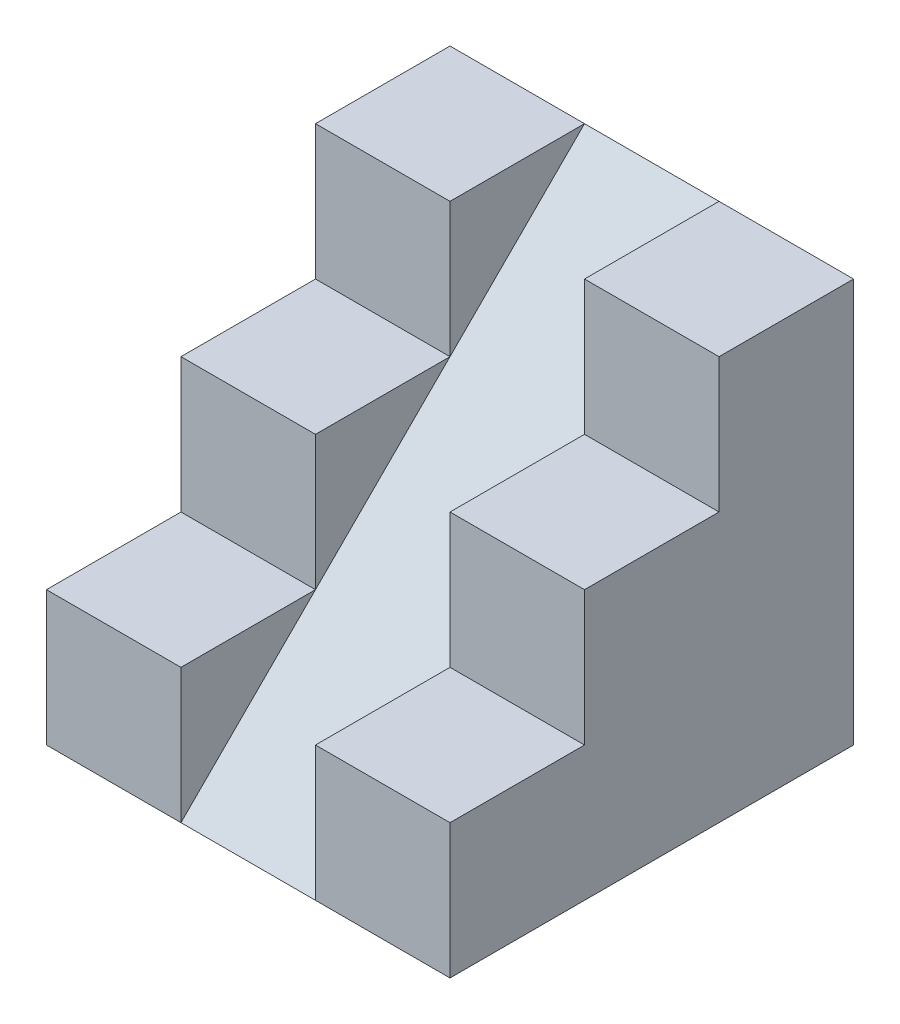
ISO-10303-21;
HEADER;
FILE_DESCRIPTION(('STEP AP214'),'2;1');
FILE_NAME('part.step','',(''),(''),'','','');
FILE_SCHEMA(('AUTOMOTIVE_DESIGN { 1 0 10303 214 1 1 1 1 }'));
ENDSEC;
DATA;
#1=APPLICATION_CONTEXT('core data for automotive mechanical design processes');
#2=APPLICATION_PROTOCOL_DEFINITION('international standard','automotive_design',2000,#1);
#3=PRODUCT_CONTEXT('',#1,'mechanical');
#4=PRODUCT('Part','Part','',(#3));
#5=PRODUCT_RELATED_PRODUCT_CATEGORY('part','',(#4));
#6=PRODUCT_DEFINITION_FORMATION('','',#4);
#7=PRODUCT_DEFINITION_CONTEXT('part definition',#1,'design');
#8=PRODUCT_DEFINITION('design','',#6,#7);
#9=PRODUCT_DEFINITION_SHAPE('','',#8);
#10=(LENGTH_UNIT() NAMED_UNIT(*) SI_UNIT(.MILLI.,.METRE.));
#11=(NAMED_UNIT(*) PLANE_ANGLE_UNIT() SI_UNIT($,.RADIAN.));
#12=(NAMED_UNIT(*) SI_UNIT($,.STERADIAN.) SOLID_ANGLE_UNIT());
#13=UNCERTAINTY_MEASURE_WITH_UNIT(LENGTH_MEASURE(1.E-05),#10,'distance_accuracy_value','');
#14=(GEOMETRIC_REPRESENTATION_CONTEXT(3) GLOBAL_UNCERTAINTY_ASSIGNED_CONTEXT((#13)) GLOBAL_UNIT_ASSIGNED_CONTEXT((#10,
#11,#12)) REPRESENTATION_CONTEXT('',''));
#15=CARTESIAN_POINT('',(0.,0.,0.));
#16=DIRECTION('',(0.,0.,1.));
#17=DIRECTION('',(1.,0.,0.));
#18=AXIS2_PLACEMENT_3D('',#15,#16,#17);
#19=CARTESIAN_POINT('',(0.,19.9999999999997,0.));
#20=DIRECTION('',(0.,1.,0.));
#21=DIRECTION('',(0.,0.,1.));
#22=AXIS2_PLACEMENT_3D('',#19,#20,#21);
#23=PLANE('',#22);
#24=DIRECTION('',(1.,0.,0.));
#25=VECTOR('',#24,1.);
#26=CARTESIAN_POINT('',(0.,19.9999999999997,60.));
#27=LINE('',#26,#25);
#28=CARTESIAN_POINT('',(0.,19.9999999999997,60.));
#29=VERTEX_POINT('',#28);
#30=CARTESIAN_POINT('',(20.,19.9999999999997,60.));
#31=VERTEX_POINT('',#30);
#32=EDGE_CURVE('E219',#29,#31,#27,.T.);
#33=ORIENTED_EDGE('',*,*,#32,.T.);
#34=DIRECTION('',(0.,0.,1.));
#35=VECTOR('',#34,1.);
#36=CARTESIAN_POINT('',(20.,19.9999999999997,60.));
#37=LINE('',#36,#35);
#38=CARTESIAN_POINT('',(20.,19.9999999999999,40.0000000000001));
#39=VERTEX_POINT('',#38);
#40=EDGE_CURVE('E261',#39,#31,#37,.T.);
#41=ORIENTED_EDGE('',*,*,#40,.F.);
#42=DIRECTION('',(1.,0.,0.));
#43=VECTOR('',#42,1.);
#44=CARTESIAN_POINT('',(0.,19.9999999999999,40.0000000000001));
#45=LINE('',#44,#43);
#46=CARTESIAN_POINT('',(0.,19.9999999999999,40.0000000000001));
#47=VERTEX_POINT('',#46);
#48=EDGE_CURVE('E195',#47,#39,#45,.T.);
#49=ORIENTED_EDGE('',*,*,#48,.F.);
#50=DIRECTION('',(0.,0.,1.));
#51=VECTOR('',#50,1.);
#52=CARTESIAN_POINT('',(0.,19.9999999999997,0.));
#53=LINE('',#52,#51);
#54=EDGE_CURVE('E54',#47,#29,#53,.T.);
#55=ORIENTED_EDGE('',*,*,#54,.T.);
#56=EDGE_LOOP('',(#33,#41,#49,#55));
#57=FACE_BOUND('',#56,.T.);
#58=ADVANCED_FACE('F39',(#57),#23,.T.);
#59=CARTESIAN_POINT('',(0.,0.,60.));
#60=DIRECTION('',(0.,0.,-1.));
#61=DIRECTION('',(-1.,0.,0.));
#62=AXIS2_PLACEMENT_3D('',#59,#60,#61);
#63=PLANE('',#62);
#64=DIRECTION('',(0.,-1.,0.));
#65=VECTOR('',#64,1.);
#66=CARTESIAN_POINT('',(20.,0.,60.));
#67=LINE('',#66,#65);
#68=CARTESIAN_POINT('',(20.,0.,60.));
#69=VERTEX_POINT('',#68);
#70=EDGE_CURVE('E256',#31,#69,#67,.T.);
#71=ORIENTED_EDGE('',*,*,#70,.F.);
#72=ORIENTED_EDGE('',*,*,#32,.F.);
#73=DIRECTION('',(0.,-1.,0.));
#74=VECTOR('',#73,1.);
#75=CARTESIAN_POINT('',(0.,0.,60.));
#76=LINE('',#75,#74);
#77=CARTESIAN_POINT('',(0.,0.,60.));
#78=VERTEX_POINT('',#77);
#79=EDGE_CURVE('E125',#29,#78,#76,.T.);
#80=ORIENTED_EDGE('',*,*,#79,.T.);
#81=DIRECTION('',(1.,0.,0.));
#82=VECTOR('',#81,1.);
#83=CARTESIAN_POINT('',(0.,0.,60.));
#84=LINE('',#83,#82);
#85=EDGE_CURVE('E229',#78,#69,#84,.T.);
#86=ORIENTED_EDGE('',*,*,#85,.T.);
#87=EDGE_LOOP('',(#71,#72,#80,#86));
#88=FACE_BOUND('',#87,.T.);
#89=ADVANCED_FACE('F346',(#88),#63,.F.);
#90=DIRECTION('',(0.,0.,1.));
#91=VECTOR('',#90,1.);
#92=CARTESIAN_POINT('',(40.,19.9999999999997,60.));
#93=LINE('',#92,#91);
#94=CARTESIAN_POINT('',(40.,19.9999999999999,40.0000000000001));
#95=VERTEX_POINT('',#94);
#96=CARTESIAN_POINT('',(40.,19.9999999999997,60.));
#97=VERTEX_POINT('',#96);
#98=EDGE_CURVE('E247',#95,#97,#93,.T.);
#99=ORIENTED_EDGE('',*,*,#98,.T.);
#100=CARTESIAN_POINT('',(60.,19.9999999999997,60.));
#101=VERTEX_POINT('',#100);
#102=EDGE_CURVE('E221',#97,#101,#27,.T.);
#103=ORIENTED_EDGE('',*,*,#102,.T.);
#104=DIRECTION('',(0.,0.,1.));
#105=VECTOR('',#104,1.);
#106=CARTESIAN_POINT('',(60.,19.9999999999997,0.));
#107=LINE('',#106,#105);
#108=CARTESIAN_POINT('',(60.,19.9999999999999,40.0000000000001));
#109=VERTEX_POINT('',#108);
#110=EDGE_CURVE('E203',#109,#101,#107,.T.);
#111=ORIENTED_EDGE('',*,*,#110,.F.);
#112=EDGE_CURVE('E200',#95,#109,#45,.T.);
#113=ORIENTED_EDGE('',*,*,#112,.F.);
#114=EDGE_LOOP('',(#99,#103,#111,#113));
#115=FACE_BOUND('',#114,.T.);
#116=ADVANCED_FACE('F245',(#115),#23,.T.);
#117=CARTESIAN_POINT('',(40.,19.9999999999999,20.0000000000001));
#118=DIRECTION('',(-1.,0.,0.));
#119=DIRECTION('',(0.,0.,1.));
#120=AXIS2_PLACEMENT_3D('',#117,#118,#119);
#121=PLANE('',#120);
#122=DIRECTION('',(0.,0.,1.));
#123=VECTOR('',#122,1.);
#124=CARTESIAN_POINT('',(40.,39.9999999999999,20.0000000000001));
#125=LINE('',#124,#123);
#126=CARTESIAN_POINT('',(40.,40.,20.0000000000001));
#127=VERTEX_POINT('',#126);
#128=CARTESIAN_POINT('',(40.,39.9999999999999,40.0000000000001));
#129=VERTEX_POINT('',#128);
#130=EDGE_CURVE('E192',#127,#129,#125,.T.);
#131=ORIENTED_EDGE('',*,*,#130,.F.);
#132=DIRECTION('',(0.,-0.707106781186548,0.707106781186548));
#133=VECTOR('',#132,1.);
#134=CARTESIAN_POINT('',(40.,30.,30.));
#135=LINE('',#134,#133);
#136=EDGE_CURVE('E269',#127,#95,#135,.T.);
#137=ORIENTED_EDGE('',*,*,#136,.T.);
#138=DIRECTION('',(0.,1.,0.));
#139=VECTOR('',#138,1.);
#140=CARTESIAN_POINT('',(40.,19.9999999999999,40.0000000000001));
#141=LINE('',#140,#139);
#142=EDGE_CURVE('E281',#95,#129,#141,.T.);
#143=ORIENTED_EDGE('',*,*,#142,.T.);
#144=EDGE_LOOP('',(#131,#137,#143));
#145=FACE_BOUND('',#144,.T.);
#146=ADVANCED_FACE('F305',(#145),#121,.T.);
#147=CARTESIAN_POINT('',(20.,19.9999999999999,20.0000000000001));
#148=DIRECTION('',(-1.,0.,0.));
#149=DIRECTION('',(0.,0.,1.));
#150=AXIS2_PLACEMENT_3D('',#147,#148,#149);
#151=PLANE('',#150);
#152=DIRECTION('',(0.,-0.707106781186548,0.707106781186548));
#153=VECTOR('',#152,1.);
#154=CARTESIAN_POINT('',(20.,30.,30.));
#155=LINE('',#154,#153);
#156=CARTESIAN_POINT('',(20.,39.9999999999999,20.0000000000001));
#157=VERTEX_POINT('',#156);
#158=EDGE_CURVE('E268',#157,#39,#155,.T.);
#159=ORIENTED_EDGE('',*,*,#158,.F.);
#160=DIRECTION('',(0.,0.,1.));
#161=VECTOR('',#160,1.);
#162=CARTESIAN_POINT('',(20.,39.9999999999999,20.0000000000001));
#163=LINE('',#162,#161);
#164=CARTESIAN_POINT('',(20.,39.9999999999999,40.0000000000001));
#165=VERTEX_POINT('',#164);
#166=EDGE_CURVE('E275',#157,#165,#163,.T.);
#167=ORIENTED_EDGE('',*,*,#166,.T.);
#168=DIRECTION('',(0.,1.,0.));
#169=VECTOR('',#168,1.);
#170=CARTESIAN_POINT('',(20.,19.9999999999999,40.0000000000001));
#171=LINE('',#170,#169);
#172=EDGE_CURVE('E278',#39,#165,#171,.T.);
#173=ORIENTED_EDGE('',*,*,#172,.F.);
#174=EDGE_LOOP('',(#159,#167,#173));
#175=FACE_BOUND('',#174,.T.);
#176=ADVANCED_FACE('F318',(#175),#151,.F.);
#177=CARTESIAN_POINT('',(0.,39.9999999999999,0.));
#178=DIRECTION('',(0.,1.,0.));
#179=DIRECTION('',(0.,0.,1.));
#180=AXIS2_PLACEMENT_3D('',#177,#178,#179);
#181=PLANE('',#180);
#182=DIRECTION('',(1.,0.,0.));
#183=VECTOR('',#182,1.);
#184=CARTESIAN_POINT('',(0.,40.,20.0000000000001));
#185=LINE('',#184,#183);
#186=CARTESIAN_POINT('',(60.,40.,20.0000000000001));
#187=VERTEX_POINT('',#186);
#188=EDGE_CURVE('E228',#127,#187,#185,.T.);
#189=ORIENTED_EDGE('',*,*,#188,.F.);
#190=ORIENTED_EDGE('',*,*,#130,.T.);
#191=DIRECTION('',(1.,0.,0.));
#192=VECTOR('',#191,1.);
#193=CARTESIAN_POINT('',(0.,39.9999999999999,40.0000000000001));
#194=LINE('',#193,#192);
#195=CARTESIAN_POINT('',(60.,39.9999999999999,40.0000000000001));
#196=VERTEX_POINT('',#195);
#197=EDGE_CURVE('E118',#129,#196,#194,.T.);
#198=ORIENTED_EDGE('',*,*,#197,.T.);
#199=DIRECTION('',(0.,0.,1.));
#200=VECTOR('',#199,1.);
#201=CARTESIAN_POINT('',(60.,39.9999999999999,0.));
#202=LINE('',#201,#200);
#203=EDGE_CURVE('E188',#187,#196,#202,.T.);
#204=ORIENTED_EDGE('',*,*,#203,.F.);
#205=EDGE_LOOP('',(#189,#190,#198,#204));
#206=FACE_BOUND('',#205,.T.);
#207=ADVANCED_FACE('F186',(#206),#181,.T.);
#208=CARTESIAN_POINT('',(0.,0.,40.0000000000001));
#209=DIRECTION('',(0.,0.,-1.));
#210=DIRECTION('',(-1.,0.,0.));
#211=AXIS2_PLACEMENT_3D('',#208,#209,#210);
#212=PLANE('',#211);
#213=ORIENTED_EDGE('',*,*,#142,.F.);
#214=ORIENTED_EDGE('',*,*,#112,.T.);
#215=DIRECTION('',(0.,1.,0.));
#216=VECTOR('',#215,1.);
#217=CARTESIAN_POINT('',(60.,0.,40.0000000000001));
#218=LINE('',#217,#216);
#219=EDGE_CURVE('E197',#109,#196,#218,.T.);
#220=ORIENTED_EDGE('',*,*,#219,.T.);
#221=ORIENTED_EDGE('',*,*,#197,.F.);
#222=EDGE_LOOP('',(#213,#214,#220,#221));
#223=FACE_BOUND('',#222,.T.);
#224=ADVANCED_FACE('F198',(#223),#212,.F.);
#225=ORIENTED_EDGE('',*,*,#166,.F.);
#226=CARTESIAN_POINT('',(0.,40.,20.0000000000001));
#227=VERTEX_POINT('',#226);
#228=EDGE_CURVE('E225',#227,#157,#185,.T.);
#229=ORIENTED_EDGE('',*,*,#228,.F.);
#230=DIRECTION('',(0.,0.,1.));
#231=VECTOR('',#230,1.);
#232=CARTESIAN_POINT('',(0.,39.9999999999999,0.));
#233=LINE('',#232,#231);
#234=CARTESIAN_POINT('',(0.,39.9999999999999,40.0000000000001));
#235=VERTEX_POINT('',#234);
#236=EDGE_CURVE('E202',#227,#235,#233,.T.);
#237=ORIENTED_EDGE('',*,*,#236,.T.);
#238=EDGE_CURVE('E114',#235,#165,#194,.T.);
#239=ORIENTED_EDGE('',*,*,#238,.T.);
#240=EDGE_LOOP('',(#225,#229,#237,#239));
#241=FACE_BOUND('',#240,.T.);
#242=ADVANCED_FACE('F324',(#241),#181,.T.);
#243=CARTESIAN_POINT('',(40.,40.,0.));
#244=DIRECTION('',(-1.,0.,0.));
#245=DIRECTION('',(0.,0.,1.));
#246=AXIS2_PLACEMENT_3D('',#243,#244,#245);
#247=PLANE('',#246);
#248=DIRECTION('',(0.,0.,1.));
#249=VECTOR('',#248,1.);
#250=CARTESIAN_POINT('',(40.,60.,0.));
#251=LINE('',#250,#249);
#252=CARTESIAN_POINT('',(40.,60.,0.));
#253=VERTEX_POINT('',#252);
#254=CARTESIAN_POINT('',(40.,60.,20.0000000000001));
#255=VERTEX_POINT('',#254);
#256=EDGE_CURVE('E145',#253,#255,#251,.T.);
#257=ORIENTED_EDGE('',*,*,#256,.F.);
#258=DIRECTION('',(0.,-0.707106781186546,0.707106781186549));
#259=VECTOR('',#258,1.);
#260=CARTESIAN_POINT('',(40.,40.,20.0000000000001));
#261=LINE('',#260,#259);
#262=EDGE_CURVE('E285',#253,#127,#261,.T.);
#263=ORIENTED_EDGE('',*,*,#262,.T.);
#264=DIRECTION('',(0.,1.,0.));
#265=VECTOR('',#264,1.);
#266=CARTESIAN_POINT('',(40.,40.,20.0000000000001));
#267=LINE('',#266,#265);
#268=EDGE_CURVE('E207',#127,#255,#267,.T.);
#269=ORIENTED_EDGE('',*,*,#268,.T.);
#270=EDGE_LOOP('',(#257,#263,#269));
#271=FACE_BOUND('',#270,.T.);
#272=ADVANCED_FACE('F366',(#271),#247,.T.);
#273=CARTESIAN_POINT('',(20.,40.,0.));
#274=DIRECTION('',(-1.,0.,0.));
#275=DIRECTION('',(0.,0.,1.));
#276=AXIS2_PLACEMENT_3D('',#273,#274,#275);
#277=PLANE('',#276);
#278=DIRECTION('',(0.,-0.707106781186546,0.707106781186549));
#279=VECTOR('',#278,1.);
#280=CARTESIAN_POINT('',(20.,40.,20.0000000000001));
#281=LINE('',#280,#279);
#282=CARTESIAN_POINT('',(20.,60.,0.));
#283=VERTEX_POINT('',#282);
#284=EDGE_CURVE('E284',#283,#157,#281,.T.);
#285=ORIENTED_EDGE('',*,*,#284,.F.);
#286=DIRECTION('',(0.,0.,1.));
#287=VECTOR('',#286,1.);
#288=CARTESIAN_POINT('',(20.,60.,0.));
#289=LINE('',#288,#287);
#290=CARTESIAN_POINT('',(20.,60.,20.0000000000001));
#291=VERTEX_POINT('',#290);
#292=EDGE_CURVE('E92',#283,#291,#289,.T.);
#293=ORIENTED_EDGE('',*,*,#292,.T.);
#294=DIRECTION('',(0.,1.,0.));
#295=VECTOR('',#294,1.);
#296=CARTESIAN_POINT('',(20.,40.,20.0000000000001));
#297=LINE('',#296,#295);
#298=EDGE_CURVE('E210',#157,#291,#297,.T.);
#299=ORIENTED_EDGE('',*,*,#298,.F.);
#300=EDGE_LOOP('',(#285,#293,#299));
#301=FACE_BOUND('',#300,.T.);
#302=ADVANCED_FACE('F328',(#301),#277,.F.);
#303=CARTESIAN_POINT('',(0.,60.,60.));
#304=DIRECTION('',(0.,-1.,0.));
#305=DIRECTION('',(0.,0.,-1.));
#306=AXIS2_PLACEMENT_3D('',#303,#304,#305);
#307=PLANE('',#306);
#308=ORIENTED_EDGE('',*,*,#256,.T.);
#309=DIRECTION('',(1.,0.,0.));
#310=VECTOR('',#309,1.);
#311=CARTESIAN_POINT('',(0.,60.,20.0000000000001));
#312=LINE('',#311,#310);
#313=CARTESIAN_POINT('',(60.,60.,20.0000000000001));
#314=VERTEX_POINT('',#313);
#315=EDGE_CURVE('E224',#255,#314,#312,.T.);
#316=ORIENTED_EDGE('',*,*,#315,.T.);
#317=DIRECTION('',(0.,0.,-1.));
#318=VECTOR('',#317,1.);
#319=CARTESIAN_POINT('',(60.,60.,60.));
#320=LINE('',#319,#318);
#321=CARTESIAN_POINT('',(60.,60.,0.));
#322=VERTEX_POINT('',#321);
#323=EDGE_CURVE('E108',#314,#322,#320,.T.);
#324=ORIENTED_EDGE('',*,*,#323,.T.);
#325=DIRECTION('',(-1.,0.,0.));
#326=VECTOR('',#325,1.);
#327=CARTESIAN_POINT('',(0.,60.,0.));
#328=LINE('',#327,#326);
#329=EDGE_CURVE('E97',#322,#253,#328,.T.);
#330=ORIENTED_EDGE('',*,*,#329,.T.);
#331=EDGE_LOOP('',(#308,#316,#324,#330));
#332=FACE_BOUND('',#331,.T.);
#333=ADVANCED_FACE('F141',(#332),#307,.F.);
#334=CARTESIAN_POINT('',(0.,0.,0.));
#335=DIRECTION('',(0.,0.,-1.));
#336=DIRECTION('',(-1.,0.,0.));
#337=AXIS2_PLACEMENT_3D('',#334,#335,#336);
#338=PLANE('',#337);
#339=DIRECTION('',(-1.,0.,0.));
#340=VECTOR('',#339,1.);
#341=CARTESIAN_POINT('',(40.,60.,0.));
#342=LINE('',#341,#340);
#343=EDGE_CURVE('E137',#253,#283,#342,.T.);
#344=ORIENTED_EDGE('',*,*,#343,.F.);
#345=ORIENTED_EDGE('',*,*,#329,.F.);
#346=DIRECTION('',(0.,1.,0.));
#347=VECTOR('',#346,1.);
#348=CARTESIAN_POINT('',(60.,60.,0.));
#349=LINE('',#348,#347);
#350=CARTESIAN_POINT('',(60.,0.,0.));
#351=VERTEX_POINT('',#350);
#352=EDGE_CURVE('E98',#351,#322,#349,.T.);
#353=ORIENTED_EDGE('',*,*,#352,.F.);
#354=DIRECTION('',(1.,0.,0.));
#355=VECTOR('',#354,1.);
#356=CARTESIAN_POINT('',(0.,0.,0.));
#357=LINE('',#356,#355);
#358=CARTESIAN_POINT('',(0.,0.,0.));
#359=VERTEX_POINT('',#358);
#360=EDGE_CURVE('E113',#359,#351,#357,.T.);
#361=ORIENTED_EDGE('',*,*,#360,.F.);
#362=DIRECTION('',(0.,-1.,0.));
#363=VECTOR('',#362,1.);
#364=CARTESIAN_POINT('',(0.,0.,0.));
#365=LINE('',#364,#363);
#366=CARTESIAN_POINT('',(0.,60.,0.));
#367=VERTEX_POINT('',#366);
#368=EDGE_CURVE('E104',#367,#359,#365,.T.);
#369=ORIENTED_EDGE('',*,*,#368,.F.);
#370=EDGE_CURVE('E84',#283,#367,#328,.T.);
#371=ORIENTED_EDGE('',*,*,#370,.F.);
#372=EDGE_LOOP('',(#344,#345,#353,#361,#369,#371));
#373=FACE_BOUND('',#372,.T.);
#374=ADVANCED_FACE('F111',(#373),#338,.T.);
#375=CARTESIAN_POINT('',(0.,0.,20.0000000000001));
#376=DIRECTION('',(0.,0.,-1.));
#377=DIRECTION('',(-1.,0.,0.));
#378=AXIS2_PLACEMENT_3D('',#375,#376,#377);
#379=PLANE('',#378);
#380=ORIENTED_EDGE('',*,*,#268,.F.);
#381=ORIENTED_EDGE('',*,*,#188,.T.);
#382=DIRECTION('',(0.,1.,0.));
#383=VECTOR('',#382,1.);
#384=CARTESIAN_POINT('',(60.,0.,20.0000000000001));
#385=LINE('',#384,#383);
#386=EDGE_CURVE('E206',#187,#314,#385,.T.);
#387=ORIENTED_EDGE('',*,*,#386,.T.);
#388=ORIENTED_EDGE('',*,*,#315,.F.);
#389=EDGE_LOOP('',(#380,#381,#387,#388));
#390=FACE_BOUND('',#389,.T.);
#391=ADVANCED_FACE('F299',(#390),#379,.F.);
#392=CARTESIAN_POINT('',(0.,0.,60.));
#393=DIRECTION('',(1.,0.,0.));
#394=DIRECTION('',(0.,0.,-1.));
#395=AXIS2_PLACEMENT_3D('',#392,#393,#394);
#396=PLANE('',#395);
#397=ORIENTED_EDGE('',*,*,#54,.F.);
#398=DIRECTION('',(0.,1.,0.));
#399=VECTOR('',#398,1.);
#400=CARTESIAN_POINT('',(0.,0.,40.0000000000001));
#401=LINE('',#400,#399);
#402=EDGE_CURVE('E213',#47,#235,#401,.T.);
#403=ORIENTED_EDGE('',*,*,#402,.T.);
#404=ORIENTED_EDGE('',*,*,#236,.F.);
#405=DIRECTION('',(0.,1.,0.));
#406=VECTOR('',#405,1.);
#407=CARTESIAN_POINT('',(0.,0.,20.0000000000001));
#408=LINE('',#407,#406);
#409=CARTESIAN_POINT('',(0.,60.,20.0000000000001));
#410=VERTEX_POINT('',#409);
#411=EDGE_CURVE('E107',#227,#410,#408,.T.);
#412=ORIENTED_EDGE('',*,*,#411,.T.);
#413=DIRECTION('',(0.,0.,-1.));
#414=VECTOR('',#413,1.);
#415=CARTESIAN_POINT('',(0.,60.,60.));
#416=LINE('',#415,#414);
#417=EDGE_CURVE('E89',#410,#367,#416,.T.);
#418=ORIENTED_EDGE('',*,*,#417,.T.);
#419=ORIENTED_EDGE('',*,*,#368,.T.);
#420=DIRECTION('',(0.,0.,-1.));
#421=VECTOR('',#420,1.);
#422=CARTESIAN_POINT('',(0.,0.,60.));
#423=LINE('',#422,#421);
#424=EDGE_CURVE('E11',#78,#359,#423,.T.);
#425=ORIENTED_EDGE('',*,*,#424,.F.);
#426=ORIENTED_EDGE('',*,*,#79,.F.);
#427=EDGE_LOOP('',(#397,#403,#404,#412,#418,#419,#425,#426));
#428=FACE_BOUND('',#427,.T.);
#429=ADVANCED_FACE('F41',(#428),#396,.F.);
#430=CARTESIAN_POINT('',(60.,60.,60.));
#431=DIRECTION('',(-1.,0.,0.));
#432=DIRECTION('',(0.,0.,1.));
#433=AXIS2_PLACEMENT_3D('',#430,#431,#432);
#434=PLANE('',#433);
#435=ORIENTED_EDGE('',*,*,#110,.T.);
#436=DIRECTION('',(0.,1.,0.));
#437=VECTOR('',#436,1.);
#438=CARTESIAN_POINT('',(60.,60.,60.));
#439=LINE('',#438,#437);
#440=CARTESIAN_POINT('',(60.,0.,60.));
#441=VERTEX_POINT('',#440);
#442=EDGE_CURVE('E109',#441,#101,#439,.T.);
#443=ORIENTED_EDGE('',*,*,#442,.F.);
#444=DIRECTION('',(0.,0.,-1.));
#445=VECTOR('',#444,1.);
#446=CARTESIAN_POINT('',(60.,0.,60.));
#447=LINE('',#446,#445);
#448=EDGE_CURVE('E47',#441,#351,#447,.T.);
#449=ORIENTED_EDGE('',*,*,#448,.T.);
#450=ORIENTED_EDGE('',*,*,#352,.T.);
#451=ORIENTED_EDGE('',*,*,#323,.F.);
#452=ORIENTED_EDGE('',*,*,#386,.F.);
#453=ORIENTED_EDGE('',*,*,#203,.T.);
#454=ORIENTED_EDGE('',*,*,#219,.F.);
#455=EDGE_LOOP('',(#435,#443,#449,#450,#451,#452,#453,#454));
#456=FACE_BOUND('',#455,.T.);
#457=ADVANCED_FACE('F131',(#456),#434,.F.);
#458=ORIENTED_EDGE('',*,*,#102,.F.);
#459=DIRECTION('',(0.,-1.,0.));
#460=VECTOR('',#459,1.);
#461=CARTESIAN_POINT('',(40.,0.,60.));
#462=LINE('',#461,#460);
#463=CARTESIAN_POINT('',(40.,0.,60.));
#464=VERTEX_POINT('',#463);
#465=EDGE_CURVE('E240',#97,#464,#462,.T.);
#466=ORIENTED_EDGE('',*,*,#465,.T.);
#467=EDGE_CURVE('E63',#464,#441,#84,.T.);
#468=ORIENTED_EDGE('',*,*,#467,.T.);
#469=ORIENTED_EDGE('',*,*,#442,.T.);
#470=EDGE_LOOP('',(#458,#466,#468,#469));
#471=FACE_BOUND('',#470,.T.);
#472=ADVANCED_FACE('F236',(#471),#63,.F.);
#473=CARTESIAN_POINT('',(0.,0.,60.));
#474=DIRECTION('',(0.,1.,0.));
#475=DIRECTION('',(0.,0.,1.));
#476=AXIS2_PLACEMENT_3D('',#473,#474,#475);
#477=PLANE('',#476);
#478=ORIENTED_EDGE('',*,*,#360,.T.);
#479=ORIENTED_EDGE('',*,*,#448,.F.);
#480=ORIENTED_EDGE('',*,*,#467,.F.);
#481=DIRECTION('',(-1.,0.,0.));
#482=VECTOR('',#481,1.);
#483=CARTESIAN_POINT('',(40.,0.,60.));
#484=LINE('',#483,#482);
#485=EDGE_CURVE('E260',#464,#69,#484,.T.);
#486=ORIENTED_EDGE('',*,*,#485,.T.);
#487=ORIENTED_EDGE('',*,*,#85,.F.);
#488=ORIENTED_EDGE('',*,*,#424,.T.);
#489=EDGE_LOOP('',(#478,#479,#480,#486,#487,#488));
#490=FACE_BOUND('',#489,.T.);
#491=ADVANCED_FACE('F373',(#490),#477,.F.);
#492=EDGE_CURVE('E222',#410,#291,#312,.T.);
#493=ORIENTED_EDGE('',*,*,#492,.T.);
#494=ORIENTED_EDGE('',*,*,#292,.F.);
#495=ORIENTED_EDGE('',*,*,#370,.T.);
#496=ORIENTED_EDGE('',*,*,#417,.F.);
#497=EDGE_LOOP('',(#493,#494,#495,#496));
#498=FACE_BOUND('',#497,.T.);
#499=ADVANCED_FACE('F87',(#498),#307,.F.);
#500=ORIENTED_EDGE('',*,*,#48,.T.);
#501=ORIENTED_EDGE('',*,*,#172,.T.);
#502=ORIENTED_EDGE('',*,*,#238,.F.);
#503=ORIENTED_EDGE('',*,*,#402,.F.);
#504=EDGE_LOOP('',(#500,#501,#502,#503));
#505=FACE_BOUND('',#504,.T.);
#506=ADVANCED_FACE('F323',(#505),#212,.F.);
#507=ORIENTED_EDGE('',*,*,#228,.T.);
#508=ORIENTED_EDGE('',*,*,#298,.T.);
#509=ORIENTED_EDGE('',*,*,#492,.F.);
#510=ORIENTED_EDGE('',*,*,#411,.F.);
#511=EDGE_LOOP('',(#507,#508,#509,#510));
#512=FACE_BOUND('',#511,.T.);
#513=ADVANCED_FACE('F326',(#512),#379,.F.);
#514=CARTESIAN_POINT('',(40.,40.,20.0000000000001));
#515=DIRECTION('',(0.,-0.707106781186549,-0.707106781186546));
#516=DIRECTION('',(0.,0.707106781186546,-0.707106781186549));
#517=AXIS2_PLACEMENT_3D('',#514,#515,#516);
#518=PLANE('',#517);
#519=ORIENTED_EDGE('',*,*,#284,.T.);
#520=ORIENTED_EDGE('',*,*,#158,.T.);
#521=DIRECTION('',(0.,0.707106781186546,-0.707106781186549));
#522=VECTOR('',#521,1.);
#523=CARTESIAN_POINT('',(20.,19.9999999999999,40.0000000000001));
#524=LINE('',#523,#522);
#525=EDGE_CURVE('E251',#69,#39,#524,.T.);
#526=ORIENTED_EDGE('',*,*,#525,.F.);
#527=ORIENTED_EDGE('',*,*,#485,.F.);
#528=DIRECTION('',(0.,0.707106781186546,-0.707106781186549));
#529=VECTOR('',#528,1.);
#530=CARTESIAN_POINT('',(40.,19.9999999999999,40.0000000000001));
#531=LINE('',#530,#529);
#532=EDGE_CURVE('E253',#464,#95,#531,.T.);
#533=ORIENTED_EDGE('',*,*,#532,.T.);
#534=ORIENTED_EDGE('',*,*,#136,.F.);
#535=ORIENTED_EDGE('',*,*,#262,.F.);
#536=ORIENTED_EDGE('',*,*,#343,.T.);
#537=EDGE_LOOP('',(#519,#520,#526,#527,#533,#534,#535,#536));
#538=FACE_BOUND('',#537,.T.);
#539=ADVANCED_FACE('F302',(#538),#518,.F.);
#540=CARTESIAN_POINT('',(40.,0.,0.));
#541=DIRECTION('',(1.,0.,0.));
#542=DIRECTION('',(0.,0.,-1.));
#543=AXIS2_PLACEMENT_3D('',#540,#541,#542);
#544=PLANE('',#543);
#545=ORIENTED_EDGE('',*,*,#98,.F.);
#546=ORIENTED_EDGE('',*,*,#532,.F.);
#547=ORIENTED_EDGE('',*,*,#465,.F.);
#548=EDGE_LOOP('',(#545,#546,#547));
#549=FACE_BOUND('',#548,.T.);
#550=ADVANCED_FACE('F335',(#549),#544,.F.);
#551=CARTESIAN_POINT('',(20.,0.,0.));
#552=DIRECTION('',(1.,0.,0.));
#553=DIRECTION('',(0.,0.,-1.));
#554=AXIS2_PLACEMENT_3D('',#551,#552,#553);
#555=PLANE('',#554);
#556=ORIENTED_EDGE('',*,*,#40,.T.);
#557=ORIENTED_EDGE('',*,*,#70,.T.);
#558=ORIENTED_EDGE('',*,*,#525,.T.);
#559=EDGE_LOOP('',(#556,#557,#558));
#560=FACE_BOUND('',#559,.T.);
#561=ADVANCED_FACE('F337',(#560),#555,.T.);
#562=CLOSED_SHELL('',(#58,#89,#116,#146,#176,#207,#224,#242,#272,#302,#333,#374,#391,#429,#457,
#472,#491,#499,#506,#513,#539,#550,#561));
#563=MANIFOLD_SOLID_BREP('B2',#562);
#564=ADVANCED_BREP_SHAPE_REPRESENTATION('',(#18,#563),#14);
#565=SHAPE_DEFINITION_REPRESENTATION(#9,#564);
ENDSEC;
END-ISO-10303-21;
